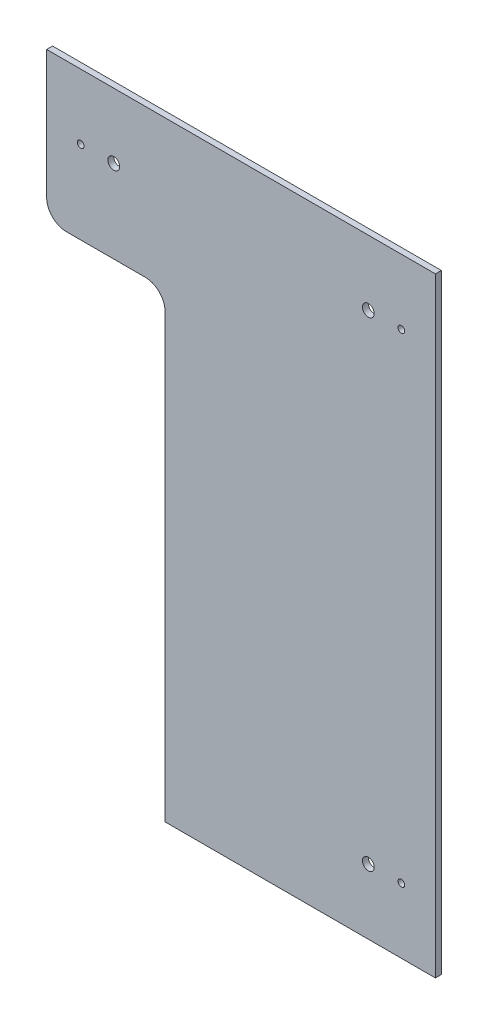
ISO-10303-21;
HEADER;
FILE_DESCRIPTION(('STEP AP214'),'2;1');
FILE_NAME('part.step','',(''),(''),'','','');
FILE_SCHEMA(('AUTOMOTIVE_DESIGN { 1 0 10303 214 1 1 1 1 }'));
ENDSEC;
DATA;
#1=APPLICATION_CONTEXT('core data for automotive mechanical design processes');
#2=APPLICATION_PROTOCOL_DEFINITION('international standard','automotive_design',2000,#1);
#3=PRODUCT_CONTEXT('',#1,'mechanical');
#4=PRODUCT('Part','Part','',(#3));
#5=PRODUCT_RELATED_PRODUCT_CATEGORY('part','',(#4));
#6=PRODUCT_DEFINITION_FORMATION('','',#4);
#7=PRODUCT_DEFINITION_CONTEXT('part definition',#1,'design');
#8=PRODUCT_DEFINITION('design','',#6,#7);
#9=PRODUCT_DEFINITION_SHAPE('','',#8);
#10=(LENGTH_UNIT() NAMED_UNIT(*) SI_UNIT(.MILLI.,.METRE.));
#11=(NAMED_UNIT(*) PLANE_ANGLE_UNIT() SI_UNIT($,.RADIAN.));
#12=(NAMED_UNIT(*) SI_UNIT($,.STERADIAN.) SOLID_ANGLE_UNIT());
#13=UNCERTAINTY_MEASURE_WITH_UNIT(LENGTH_MEASURE(1.E-05),#10,'distance_accuracy_value','');
#14=(GEOMETRIC_REPRESENTATION_CONTEXT(3) GLOBAL_UNCERTAINTY_ASSIGNED_CONTEXT((#13)) GLOBAL_UNIT_ASSIGNED_CONTEXT((#10,
#11,#12)) REPRESENTATION_CONTEXT('',''));
#15=CARTESIAN_POINT('',(0.,0.,0.));
#16=DIRECTION('',(0.,0.,1.));
#17=DIRECTION('',(1.,0.,0.));
#18=AXIS2_PLACEMENT_3D('',#15,#16,#17);
#19=CARTESIAN_POINT('',(0.,0.,3.));
#20=DIRECTION('',(0.,0.,-1.));
#21=DIRECTION('',(-1.,0.,0.));
#22=AXIS2_PLACEMENT_3D('',#19,#20,#21);
#23=PLANE('',#22);
#24=DIRECTION('',(0.,-1.,0.));
#25=VECTOR('',#24,1.);
#26=CARTESIAN_POINT('',(-98.5,-154.5,3.));
#27=LINE('',#26,#25);
#28=CARTESIAN_POINT('',(-98.5,154.5,3.));
#29=VERTEX_POINT('',#28);
#30=CARTESIAN_POINT('',(-98.5,89.5,3.));
#31=VERTEX_POINT('',#30);
#32=EDGE_CURVE('E128',#29,#31,#27,.T.);
#33=ORIENTED_EDGE('',*,*,#32,.T.);
#34=CARTESIAN_POINT('',(-88.5,89.5,3.));
#35=DIRECTION('',(0.,0.,-1.));
#36=DIRECTION('',(-1.,0.,0.));
#37=AXIS2_PLACEMENT_3D('',#34,#35,#36);
#38=CIRCLE('',#37,10.);
#39=CARTESIAN_POINT('',(-88.5,79.5,3.));
#40=VERTEX_POINT('',#39);
#41=EDGE_CURVE('E156',#31,#40,#38,.F.);
#42=ORIENTED_EDGE('',*,*,#41,.T.);
#43=DIRECTION('',(-1.,0.,0.));
#44=VECTOR('',#43,1.);
#45=CARTESIAN_POINT('',(-98.5,79.5,3.));
#46=LINE('',#45,#44);
#47=CARTESIAN_POINT('',(-48.5,79.5,3.));
#48=VERTEX_POINT('',#47);
#49=EDGE_CURVE('E122',#48,#40,#46,.T.);
#50=ORIENTED_EDGE('',*,*,#49,.F.);
#51=CARTESIAN_POINT('',(-48.5,69.5,3.));
#52=DIRECTION('',(0.,0.,-1.));
#53=DIRECTION('',(-1.,0.,0.));
#54=AXIS2_PLACEMENT_3D('',#51,#52,#53);
#55=CIRCLE('',#54,10.);
#56=CARTESIAN_POINT('',(-38.5,69.5,3.));
#57=VERTEX_POINT('',#56);
#58=EDGE_CURVE('E47',#48,#57,#55,.T.);
#59=ORIENTED_EDGE('',*,*,#58,.T.);
#60=DIRECTION('',(0.,1.,0.));
#61=VECTOR('',#60,1.);
#62=CARTESIAN_POINT('',(-38.5,79.5,3.));
#63=LINE('',#62,#61);
#64=CARTESIAN_POINT('',(-38.5,-154.5,3.));
#65=VERTEX_POINT('',#64);
#66=EDGE_CURVE('E107',#65,#57,#63,.T.);
#67=ORIENTED_EDGE('',*,*,#66,.F.);
#68=DIRECTION('',(1.,0.,0.));
#69=VECTOR('',#68,1.);
#70=CARTESIAN_POINT('',(-98.5,-154.5,3.));
#71=LINE('',#70,#69);
#72=CARTESIAN_POINT('',(98.5,-154.5,3.));
#73=VERTEX_POINT('',#72);
#74=EDGE_CURVE('E119',#65,#73,#71,.T.);
#75=ORIENTED_EDGE('',*,*,#74,.T.);
#76=DIRECTION('',(0.,1.,0.));
#77=VECTOR('',#76,1.);
#78=CARTESIAN_POINT('',(98.5,-154.5,3.));
#79=LINE('',#78,#77);
#80=CARTESIAN_POINT('',(98.5,154.5,3.));
#81=VERTEX_POINT('',#80);
#82=EDGE_CURVE('E146',#73,#81,#79,.T.);
#83=ORIENTED_EDGE('',*,*,#82,.T.);
#84=DIRECTION('',(-1.,0.,0.));
#85=VECTOR('',#84,1.);
#86=CARTESIAN_POINT('',(-98.5,154.5,3.));
#87=LINE('',#86,#85);
#88=EDGE_CURVE('E132',#81,#29,#87,.T.);
#89=ORIENTED_EDGE('',*,*,#88,.T.);
#90=EDGE_LOOP('',(#33,#42,#50,#59,#67,#75,#83,#89));
#91=FACE_BOUND('',#90,.T.);
#92=CARTESIAN_POINT('',(81.25,121.5,3.));
#93=DIRECTION('',(0.,0.,1.));
#94=DIRECTION('',(1.,0.,0.));
#95=AXIS2_PLACEMENT_3D('',#92,#93,#94);
#96=CIRCLE('',#95,1.70000000000001);
#97=CARTESIAN_POINT('',(82.95,121.5,3.));
#98=VERTEX_POINT('',#97);
#99=EDGE_CURVE('E140',#98,#98,#96,.T.);
#100=ORIENTED_EDGE('',*,*,#99,.F.);
#101=EDGE_LOOP('',(#100));
#102=FACE_BOUND('',#101,.T.);
#103=CARTESIAN_POINT('',(64.5,121.5,3.));
#104=DIRECTION('',(0.,0.,1.));
#105=DIRECTION('',(1.,0.,0.));
#106=AXIS2_PLACEMENT_3D('',#103,#104,#105);
#107=CIRCLE('',#106,3.00000000000001);
#108=CARTESIAN_POINT('',(67.5,121.5,3.));
#109=VERTEX_POINT('',#108);
#110=EDGE_CURVE('E206',#109,#109,#107,.T.);
#111=ORIENTED_EDGE('',*,*,#110,.F.);
#112=EDGE_LOOP('',(#111));
#113=FACE_BOUND('',#112,.T.);
#114=CARTESIAN_POINT('',(81.25,-121.5,3.));
#115=DIRECTION('',(0.,0.,1.));
#116=DIRECTION('',(-1.,0.,0.));
#117=AXIS2_PLACEMENT_3D('',#114,#115,#116);
#118=CIRCLE('',#117,1.70000000000001);
#119=CARTESIAN_POINT('',(79.55,-121.5,3.));
#120=VERTEX_POINT('',#119);
#121=EDGE_CURVE('E200',#120,#120,#118,.T.);
#122=ORIENTED_EDGE('',*,*,#121,.F.);
#123=EDGE_LOOP('',(#122));
#124=FACE_BOUND('',#123,.T.);
#125=CARTESIAN_POINT('',(64.5,-121.5,3.));
#126=DIRECTION('',(0.,0.,1.));
#127=DIRECTION('',(-1.,0.,0.));
#128=AXIS2_PLACEMENT_3D('',#125,#126,#127);
#129=CIRCLE('',#128,3.00000000000002);
#130=CARTESIAN_POINT('',(61.5,-121.5,3.));
#131=VERTEX_POINT('',#130);
#132=EDGE_CURVE('E194',#131,#131,#129,.T.);
#133=ORIENTED_EDGE('',*,*,#132,.F.);
#134=EDGE_LOOP('',(#133));
#135=FACE_BOUND('',#134,.T.);
#136=CARTESIAN_POINT('',(-81.25,121.5,3.));
#137=DIRECTION('',(0.,0.,1.));
#138=DIRECTION('',(-1.,0.,0.));
#139=AXIS2_PLACEMENT_3D('',#136,#137,#138);
#140=CIRCLE('',#139,1.70000000000001);
#141=CARTESIAN_POINT('',(-82.9500000000001,121.5,3.));
#142=VERTEX_POINT('',#141);
#143=EDGE_CURVE('E188',#142,#142,#140,.T.);
#144=ORIENTED_EDGE('',*,*,#143,.F.);
#145=EDGE_LOOP('',(#144));
#146=FACE_BOUND('',#145,.T.);
#147=CARTESIAN_POINT('',(-64.5,121.5,3.));
#148=DIRECTION('',(0.,0.,1.));
#149=DIRECTION('',(-1.,0.,0.));
#150=AXIS2_PLACEMENT_3D('',#147,#148,#149);
#151=CIRCLE('',#150,3.);
#152=CARTESIAN_POINT('',(-67.5,121.5,3.));
#153=VERTEX_POINT('',#152);
#154=EDGE_CURVE('E182',#153,#153,#151,.T.);
#155=ORIENTED_EDGE('',*,*,#154,.F.);
#156=EDGE_LOOP('',(#155));
#157=FACE_BOUND('',#156,.T.);
#158=ADVANCED_FACE('F39',(#91,#102,#113,#124,#135,#146,#157),#23,.F.);
#159=CARTESIAN_POINT('',(0.,0.,0.));
#160=DIRECTION('',(0.,0.,-1.));
#161=DIRECTION('',(-1.,0.,0.));
#162=AXIS2_PLACEMENT_3D('',#159,#160,#161);
#163=PLANE('',#162);
#164=DIRECTION('',(-1.,0.,0.));
#165=VECTOR('',#164,1.);
#166=CARTESIAN_POINT('',(-98.5,79.5,0.));
#167=LINE('',#166,#165);
#168=CARTESIAN_POINT('',(-48.5,79.5,0.));
#169=VERTEX_POINT('',#168);
#170=CARTESIAN_POINT('',(-88.5,79.5,0.));
#171=VERTEX_POINT('',#170);
#172=EDGE_CURVE('E113',#169,#171,#167,.T.);
#173=ORIENTED_EDGE('',*,*,#172,.T.);
#174=CARTESIAN_POINT('',(-88.5,89.5,0.));
#175=DIRECTION('',(0.,0.,-1.));
#176=DIRECTION('',(-1.,0.,0.));
#177=AXIS2_PLACEMENT_3D('',#174,#175,#176);
#178=CIRCLE('',#177,10.);
#179=CARTESIAN_POINT('',(-98.5,89.5,0.));
#180=VERTEX_POINT('',#179);
#181=EDGE_CURVE('E162',#171,#180,#178,.T.);
#182=ORIENTED_EDGE('',*,*,#181,.T.);
#183=DIRECTION('',(0.,-1.,0.));
#184=VECTOR('',#183,1.);
#185=CARTESIAN_POINT('',(-98.5,-154.5,0.));
#186=LINE('',#185,#184);
#187=CARTESIAN_POINT('',(-98.5,154.5,0.));
#188=VERTEX_POINT('',#187);
#189=EDGE_CURVE('E142',#188,#180,#186,.T.);
#190=ORIENTED_EDGE('',*,*,#189,.F.);
#191=DIRECTION('',(-1.,0.,0.));
#192=VECTOR('',#191,1.);
#193=CARTESIAN_POINT('',(-98.5,154.5,0.));
#194=LINE('',#193,#192);
#195=CARTESIAN_POINT('',(98.5,154.5,0.));
#196=VERTEX_POINT('',#195);
#197=EDGE_CURVE('E139',#196,#188,#194,.T.);
#198=ORIENTED_EDGE('',*,*,#197,.F.);
#199=DIRECTION('',(0.,1.,0.));
#200=VECTOR('',#199,1.);
#201=CARTESIAN_POINT('',(98.5,-154.5,0.));
#202=LINE('',#201,#200);
#203=CARTESIAN_POINT('',(98.5,-154.5,0.));
#204=VERTEX_POINT('',#203);
#205=EDGE_CURVE('E136',#204,#196,#202,.T.);
#206=ORIENTED_EDGE('',*,*,#205,.F.);
#207=DIRECTION('',(1.,0.,0.));
#208=VECTOR('',#207,1.);
#209=CARTESIAN_POINT('',(-98.5,-154.5,0.));
#210=LINE('',#209,#208);
#211=CARTESIAN_POINT('',(-38.5,-154.5,0.));
#212=VERTEX_POINT('',#211);
#213=EDGE_CURVE('E145',#212,#204,#210,.T.);
#214=ORIENTED_EDGE('',*,*,#213,.F.);
#215=DIRECTION('',(0.,1.,0.));
#216=VECTOR('',#215,1.);
#217=CARTESIAN_POINT('',(-38.5,79.5,0.));
#218=LINE('',#217,#216);
#219=CARTESIAN_POINT('',(-38.5,69.5,0.));
#220=VERTEX_POINT('',#219);
#221=EDGE_CURVE('E108',#212,#220,#218,.T.);
#222=ORIENTED_EDGE('',*,*,#221,.T.);
#223=CARTESIAN_POINT('',(-48.5,69.5,0.));
#224=DIRECTION('',(0.,0.,-1.));
#225=DIRECTION('',(-1.,0.,0.));
#226=AXIS2_PLACEMENT_3D('',#223,#224,#225);
#227=CIRCLE('',#226,10.);
#228=EDGE_CURVE('E11',#220,#169,#227,.F.);
#229=ORIENTED_EDGE('',*,*,#228,.T.);
#230=EDGE_LOOP('',(#173,#182,#190,#198,#206,#214,#222,#229));
#231=FACE_BOUND('',#230,.T.);
#232=CARTESIAN_POINT('',(-81.25,121.5,0.));
#233=DIRECTION('',(0.,0.,1.));
#234=DIRECTION('',(-1.,0.,0.));
#235=AXIS2_PLACEMENT_3D('',#232,#233,#234);
#236=CIRCLE('',#235,1.70000000000001);
#237=CARTESIAN_POINT('',(-82.9500000000001,121.5,0.));
#238=VERTEX_POINT('',#237);
#239=EDGE_CURVE('E185',#238,#238,#236,.T.);
#240=ORIENTED_EDGE('',*,*,#239,.T.);
#241=EDGE_LOOP('',(#240));
#242=FACE_BOUND('',#241,.T.);
#243=CARTESIAN_POINT('',(64.5,-121.5,0.));
#244=DIRECTION('',(0.,0.,1.));
#245=DIRECTION('',(-1.,0.,0.));
#246=AXIS2_PLACEMENT_3D('',#243,#244,#245);
#247=CIRCLE('',#246,3.00000000000002);
#248=CARTESIAN_POINT('',(61.5,-121.5,0.));
#249=VERTEX_POINT('',#248);
#250=EDGE_CURVE('E191',#249,#249,#247,.T.);
#251=ORIENTED_EDGE('',*,*,#250,.T.);
#252=EDGE_LOOP('',(#251));
#253=FACE_BOUND('',#252,.T.);
#254=CARTESIAN_POINT('',(81.25,121.5,0.));
#255=DIRECTION('',(0.,0.,1.));
#256=DIRECTION('',(1.,0.,0.));
#257=AXIS2_PLACEMENT_3D('',#254,#255,#256);
#258=CIRCLE('',#257,1.70000000000001);
#259=CARTESIAN_POINT('',(82.95,121.5,0.));
#260=VERTEX_POINT('',#259);
#261=EDGE_CURVE('E209',#260,#260,#258,.T.);
#262=ORIENTED_EDGE('',*,*,#261,.T.);
#263=EDGE_LOOP('',(#262));
#264=FACE_BOUND('',#263,.T.);
#265=CARTESIAN_POINT('',(64.5,121.5,0.));
#266=DIRECTION('',(0.,0.,1.));
#267=DIRECTION('',(1.,0.,0.));
#268=AXIS2_PLACEMENT_3D('',#265,#266,#267);
#269=CIRCLE('',#268,3.00000000000001);
#270=CARTESIAN_POINT('',(67.5,121.5,0.));
#271=VERTEX_POINT('',#270);
#272=EDGE_CURVE('E203',#271,#271,#269,.T.);
#273=ORIENTED_EDGE('',*,*,#272,.T.);
#274=EDGE_LOOP('',(#273));
#275=FACE_BOUND('',#274,.T.);
#276=CARTESIAN_POINT('',(81.25,-121.5,0.));
#277=DIRECTION('',(0.,0.,1.));
#278=DIRECTION('',(-1.,0.,0.));
#279=AXIS2_PLACEMENT_3D('',#276,#277,#278);
#280=CIRCLE('',#279,1.70000000000001);
#281=CARTESIAN_POINT('',(79.55,-121.5,0.));
#282=VERTEX_POINT('',#281);
#283=EDGE_CURVE('E197',#282,#282,#280,.T.);
#284=ORIENTED_EDGE('',*,*,#283,.T.);
#285=EDGE_LOOP('',(#284));
#286=FACE_BOUND('',#285,.T.);
#287=CARTESIAN_POINT('',(-64.5,121.5,0.));
#288=DIRECTION('',(0.,0.,1.));
#289=DIRECTION('',(-1.,0.,0.));
#290=AXIS2_PLACEMENT_3D('',#287,#288,#289);
#291=CIRCLE('',#290,3.);
#292=CARTESIAN_POINT('',(-67.5,121.5,0.));
#293=VERTEX_POINT('',#292);
#294=EDGE_CURVE('E112',#293,#293,#291,.T.);
#295=ORIENTED_EDGE('',*,*,#294,.T.);
#296=EDGE_LOOP('',(#295));
#297=FACE_BOUND('',#296,.T.);
#298=ADVANCED_FACE('F167',(#231,#242,#253,#264,#275,#286,#297),#163,.T.);
#299=CARTESIAN_POINT('',(98.5,-154.5,3.));
#300=DIRECTION('',(-1.,0.,0.));
#301=DIRECTION('',(0.,0.,1.));
#302=AXIS2_PLACEMENT_3D('',#299,#300,#301);
#303=PLANE('',#302);
#304=ORIENTED_EDGE('',*,*,#205,.T.);
#305=DIRECTION('',(0.,0.,-1.));
#306=VECTOR('',#305,1.);
#307=CARTESIAN_POINT('',(98.5,154.5,3.));
#308=LINE('',#307,#306);
#309=EDGE_CURVE('E150',#81,#196,#308,.T.);
#310=ORIENTED_EDGE('',*,*,#309,.F.);
#311=ORIENTED_EDGE('',*,*,#82,.F.);
#312=DIRECTION('',(0.,0.,-1.));
#313=VECTOR('',#312,1.);
#314=CARTESIAN_POINT('',(98.5,-154.5,3.));
#315=LINE('',#314,#313);
#316=EDGE_CURVE('E126',#73,#204,#315,.T.);
#317=ORIENTED_EDGE('',*,*,#316,.T.);
#318=EDGE_LOOP('',(#304,#310,#311,#317));
#319=FACE_BOUND('',#318,.T.);
#320=ADVANCED_FACE('F221',(#319),#303,.F.);
#321=CARTESIAN_POINT('',(-98.5,154.5,3.));
#322=DIRECTION('',(0.,-1.,0.));
#323=DIRECTION('',(0.,0.,-1.));
#324=AXIS2_PLACEMENT_3D('',#321,#322,#323);
#325=PLANE('',#324);
#326=ORIENTED_EDGE('',*,*,#197,.T.);
#327=DIRECTION('',(0.,0.,-1.));
#328=VECTOR('',#327,1.);
#329=CARTESIAN_POINT('',(-98.5,154.5,3.));
#330=LINE('',#329,#328);
#331=EDGE_CURVE('E130',#29,#188,#330,.T.);
#332=ORIENTED_EDGE('',*,*,#331,.F.);
#333=ORIENTED_EDGE('',*,*,#88,.F.);
#334=ORIENTED_EDGE('',*,*,#309,.T.);
#335=EDGE_LOOP('',(#326,#332,#333,#334));
#336=FACE_BOUND('',#335,.T.);
#337=ADVANCED_FACE('F218',(#336),#325,.F.);
#338=CARTESIAN_POINT('',(-98.5,-154.5,3.));
#339=DIRECTION('',(1.,0.,0.));
#340=DIRECTION('',(0.,0.,-1.));
#341=AXIS2_PLACEMENT_3D('',#338,#339,#340);
#342=PLANE('',#341);
#343=ORIENTED_EDGE('',*,*,#189,.T.);
#344=DIRECTION('',(0.,0.,1.));
#345=VECTOR('',#344,1.);
#346=CARTESIAN_POINT('',(-98.5,89.5,3.));
#347=LINE('',#346,#345);
#348=EDGE_CURVE('E153',#180,#31,#347,.T.);
#349=ORIENTED_EDGE('',*,*,#348,.T.);
#350=ORIENTED_EDGE('',*,*,#32,.F.);
#351=ORIENTED_EDGE('',*,*,#331,.T.);
#352=EDGE_LOOP('',(#343,#349,#350,#351));
#353=FACE_BOUND('',#352,.T.);
#354=ADVANCED_FACE('F172',(#353),#342,.F.);
#355=CARTESIAN_POINT('',(-98.5,-154.5,3.));
#356=DIRECTION('',(0.,1.,0.));
#357=DIRECTION('',(0.,0.,1.));
#358=AXIS2_PLACEMENT_3D('',#355,#356,#357);
#359=PLANE('',#358);
#360=ORIENTED_EDGE('',*,*,#74,.F.);
#361=DIRECTION('',(0.,0.,1.));
#362=VECTOR('',#361,1.);
#363=CARTESIAN_POINT('',(-38.5,-154.5,0.));
#364=LINE('',#363,#362);
#365=EDGE_CURVE('E104',#212,#65,#364,.T.);
#366=ORIENTED_EDGE('',*,*,#365,.F.);
#367=ORIENTED_EDGE('',*,*,#213,.T.);
#368=ORIENTED_EDGE('',*,*,#316,.F.);
#369=EDGE_LOOP('',(#360,#366,#367,#368));
#370=FACE_BOUND('',#369,.T.);
#371=ADVANCED_FACE('F124',(#370),#359,.F.);
#372=CARTESIAN_POINT('',(81.25,121.5,3.));
#373=DIRECTION('',(0.,0.,-1.));
#374=DIRECTION('',(-1.,0.,0.));
#375=AXIS2_PLACEMENT_3D('',#372,#373,#374);
#376=CYLINDRICAL_SURFACE('',#375,1.70000000000001);
#377=ORIENTED_EDGE('',*,*,#99,.T.);
#378=EDGE_LOOP('',(#377));
#379=FACE_BOUND('',#378,.T.);
#380=ORIENTED_EDGE('',*,*,#261,.F.);
#381=EDGE_LOOP('',(#380));
#382=FACE_BOUND('',#381,.T.);
#383=ADVANCED_FACE('F236',(#379,#382),#376,.F.);
#384=CARTESIAN_POINT('',(64.5,121.5,3.));
#385=DIRECTION('',(0.,0.,-1.));
#386=DIRECTION('',(-1.,0.,0.));
#387=AXIS2_PLACEMENT_3D('',#384,#385,#386);
#388=CYLINDRICAL_SURFACE('',#387,3.00000000000001);
#389=ORIENTED_EDGE('',*,*,#110,.T.);
#390=EDGE_LOOP('',(#389));
#391=FACE_BOUND('',#390,.T.);
#392=ORIENTED_EDGE('',*,*,#272,.F.);
#393=EDGE_LOOP('',(#392));
#394=FACE_BOUND('',#393,.T.);
#395=ADVANCED_FACE('F314',(#391,#394),#388,.F.);
#396=CARTESIAN_POINT('',(81.25,-121.5,3.));
#397=DIRECTION('',(0.,0.,-1.));
#398=DIRECTION('',(-1.,0.,0.));
#399=AXIS2_PLACEMENT_3D('',#396,#397,#398);
#400=CYLINDRICAL_SURFACE('',#399,1.70000000000001);
#401=ORIENTED_EDGE('',*,*,#121,.T.);
#402=EDGE_LOOP('',(#401));
#403=FACE_BOUND('',#402,.T.);
#404=ORIENTED_EDGE('',*,*,#283,.F.);
#405=EDGE_LOOP('',(#404));
#406=FACE_BOUND('',#405,.T.);
#407=ADVANCED_FACE('F305',(#403,#406),#400,.F.);
#408=CARTESIAN_POINT('',(64.5,-121.5,3.));
#409=DIRECTION('',(0.,0.,-1.));
#410=DIRECTION('',(-1.,0.,0.));
#411=AXIS2_PLACEMENT_3D('',#408,#409,#410);
#412=CYLINDRICAL_SURFACE('',#411,3.00000000000002);
#413=ORIENTED_EDGE('',*,*,#132,.T.);
#414=EDGE_LOOP('',(#413));
#415=FACE_BOUND('',#414,.T.);
#416=ORIENTED_EDGE('',*,*,#250,.F.);
#417=EDGE_LOOP('',(#416));
#418=FACE_BOUND('',#417,.T.);
#419=ADVANCED_FACE('F296',(#415,#418),#412,.F.);
#420=CARTESIAN_POINT('',(-81.25,121.5,3.));
#421=DIRECTION('',(0.,0.,-1.));
#422=DIRECTION('',(-1.,0.,0.));
#423=AXIS2_PLACEMENT_3D('',#420,#421,#422);
#424=CYLINDRICAL_SURFACE('',#423,1.70000000000001);
#425=ORIENTED_EDGE('',*,*,#143,.T.);
#426=EDGE_LOOP('',(#425));
#427=FACE_BOUND('',#426,.T.);
#428=ORIENTED_EDGE('',*,*,#239,.F.);
#429=EDGE_LOOP('',(#428));
#430=FACE_BOUND('',#429,.T.);
#431=ADVANCED_FACE('F287',(#427,#430),#424,.F.);
#432=CARTESIAN_POINT('',(-64.5,121.5,3.));
#433=DIRECTION('',(0.,0.,-1.));
#434=DIRECTION('',(-1.,0.,0.));
#435=AXIS2_PLACEMENT_3D('',#432,#433,#434);
#436=CYLINDRICAL_SURFACE('',#435,3.);
#437=ORIENTED_EDGE('',*,*,#154,.T.);
#438=EDGE_LOOP('',(#437));
#439=FACE_BOUND('',#438,.T.);
#440=ORIENTED_EDGE('',*,*,#294,.F.);
#441=EDGE_LOOP('',(#440));
#442=FACE_BOUND('',#441,.T.);
#443=ADVANCED_FACE('F254',(#439,#442),#436,.F.);
#444=CARTESIAN_POINT('',(-98.5,79.5,0.));
#445=DIRECTION('',(0.,1.,0.));
#446=DIRECTION('',(0.,0.,1.));
#447=AXIS2_PLACEMENT_3D('',#444,#445,#446);
#448=PLANE('',#447);
#449=ORIENTED_EDGE('',*,*,#49,.T.);
#450=DIRECTION('',(0.,0.,1.));
#451=VECTOR('',#450,1.);
#452=CARTESIAN_POINT('',(-88.5,79.5,0.));
#453=LINE('',#452,#451);
#454=EDGE_CURVE('E62',#40,#171,#453,.F.);
#455=ORIENTED_EDGE('',*,*,#454,.T.);
#456=ORIENTED_EDGE('',*,*,#172,.F.);
#457=DIRECTION('',(0.,0.,1.));
#458=VECTOR('',#457,1.);
#459=CARTESIAN_POINT('',(-48.5,79.5,3.));
#460=LINE('',#459,#458);
#461=EDGE_CURVE('E158',#169,#48,#460,.T.);
#462=ORIENTED_EDGE('',*,*,#461,.T.);
#463=EDGE_LOOP('',(#449,#455,#456,#462));
#464=FACE_BOUND('',#463,.T.);
#465=ADVANCED_FACE('F176',(#464),#448,.F.);
#466=CARTESIAN_POINT('',(-38.5,79.5,0.));
#467=DIRECTION('',(1.,0.,0.));
#468=DIRECTION('',(0.,1.,0.));
#469=AXIS2_PLACEMENT_3D('',#466,#467,#468);
#470=PLANE('',#469);
#471=ORIENTED_EDGE('',*,*,#66,.T.);
#472=DIRECTION('',(0.,0.,1.));
#473=VECTOR('',#472,1.);
#474=CARTESIAN_POINT('',(-38.5,69.5,0.));
#475=LINE('',#474,#473);
#476=EDGE_CURVE('E54',#57,#220,#475,.F.);
#477=ORIENTED_EDGE('',*,*,#476,.T.);
#478=ORIENTED_EDGE('',*,*,#221,.F.);
#479=ORIENTED_EDGE('',*,*,#365,.T.);
#480=EDGE_LOOP('',(#471,#477,#478,#479));
#481=FACE_BOUND('',#480,.T.);
#482=ADVANCED_FACE('F106',(#481),#470,.F.);
#483=CARTESIAN_POINT('',(-88.5,89.5,3.));
#484=DIRECTION('',(0.,0.,1.));
#485=DIRECTION('',(1.,0.,0.));
#486=AXIS2_PLACEMENT_3D('',#483,#484,#485);
#487=CYLINDRICAL_SURFACE('',#486,10.);
#488=ORIENTED_EDGE('',*,*,#181,.F.);
#489=ORIENTED_EDGE('',*,*,#454,.F.);
#490=ORIENTED_EDGE('',*,*,#41,.F.);
#491=ORIENTED_EDGE('',*,*,#348,.F.);
#492=EDGE_LOOP('',(#488,#489,#490,#491));
#493=FACE_BOUND('',#492,.T.);
#494=ADVANCED_FACE('F175',(#493),#487,.T.);
#495=CARTESIAN_POINT('',(-48.5,69.5,0.));
#496=DIRECTION('',(0.,0.,-1.));
#497=DIRECTION('',(-1.,0.,0.));
#498=AXIS2_PLACEMENT_3D('',#495,#496,#497);
#499=CYLINDRICAL_SURFACE('',#498,10.);
#500=ORIENTED_EDGE('',*,*,#228,.F.);
#501=ORIENTED_EDGE('',*,*,#476,.F.);
#502=ORIENTED_EDGE('',*,*,#58,.F.);
#503=ORIENTED_EDGE('',*,*,#461,.F.);
#504=EDGE_LOOP('',(#500,#501,#502,#503));
#505=FACE_BOUND('',#504,.T.);
#506=ADVANCED_FACE('F41',(#505),#499,.F.);
#507=CLOSED_SHELL('',(#158,#298,#320,#337,#354,#371,#383,#395,#407,#419,#431,#443,#465,#482,
#494,#506));
#508=MANIFOLD_SOLID_BREP('B2',#507);
#509=ADVANCED_BREP_SHAPE_REPRESENTATION('',(#18,#508),#14);
#510=SHAPE_DEFINITION_REPRESENTATION(#9,#509);
ENDSEC;
END-ISO-10303-21;
